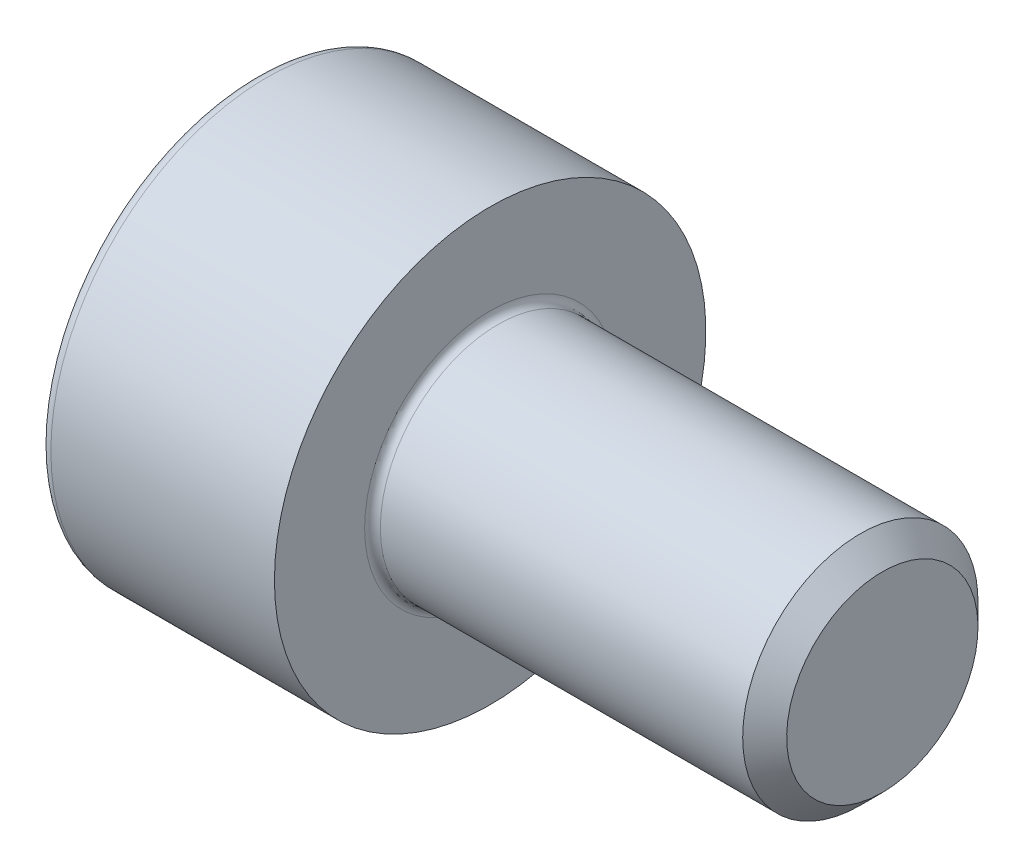
ISO-10303-21;
HEADER;
FILE_DESCRIPTION(('STEP AP214'),'2;1');
FILE_NAME('part.step','',(''),(''),'','','');
FILE_SCHEMA(('AUTOMOTIVE_DESIGN { 1 0 10303 214 1 1 1 1 }'));
ENDSEC;
DATA;
#1=APPLICATION_CONTEXT('core data for automotive mechanical design processes');
#2=APPLICATION_PROTOCOL_DEFINITION('international standard','automotive_design',2000,#1);
#3=PRODUCT_CONTEXT('',#1,'mechanical');
#4=PRODUCT('Part','Part','',(#3));
#5=PRODUCT_RELATED_PRODUCT_CATEGORY('part','',(#4));
#6=PRODUCT_DEFINITION_FORMATION('','',#4);
#7=PRODUCT_DEFINITION_CONTEXT('part definition',#1,'design');
#8=PRODUCT_DEFINITION('design','',#6,#7);
#9=PRODUCT_DEFINITION_SHAPE('','',#8);
#10=(LENGTH_UNIT() NAMED_UNIT(*) SI_UNIT(.MILLI.,.METRE.));
#11=(NAMED_UNIT(*) PLANE_ANGLE_UNIT() SI_UNIT($,.RADIAN.));
#12=(NAMED_UNIT(*) SI_UNIT($,.STERADIAN.) SOLID_ANGLE_UNIT());
#13=UNCERTAINTY_MEASURE_WITH_UNIT(LENGTH_MEASURE(1.E-05),#10,'distance_accuracy_value','');
#14=(GEOMETRIC_REPRESENTATION_CONTEXT(3) GLOBAL_UNCERTAINTY_ASSIGNED_CONTEXT((#13)) GLOBAL_UNIT_ASSIGNED_CONTEXT((#10,
#11,#12)) REPRESENTATION_CONTEXT('',''));
#15=CARTESIAN_POINT('',(0.,0.,0.));
#16=DIRECTION('',(0.,0.,1.));
#17=DIRECTION('',(1.,0.,0.));
#18=AXIS2_PLACEMENT_3D('',#15,#16,#17);
#19=CARTESIAN_POINT('',(8.,1.2195,0.));
#20=DIRECTION('',(1.,0.,0.));
#21=DIRECTION('',(0.,0.,-1.));
#22=AXIS2_PLACEMENT_3D('',#19,#20,#21);
#23=PLANE('',#22);
#24=CARTESIAN_POINT('',(7.99999999992451,0.,0.));
#25=DIRECTION('',(-1.,0.,0.));
#26=DIRECTION('',(0.,-1.,0.));
#27=AXIS2_PLACEMENT_3D('',#24,#25,#26);
#28=CIRCLE('',#27,1.2194999999906);
#29=CARTESIAN_POINT('',(7.99999999992451,-1.2194999999906,0.));
#30=VERTEX_POINT('',#29);
#31=EDGE_CURVE('E115',#30,#30,#28,.T.);
#32=ORIENTED_EDGE('',*,*,#31,.F.);
#33=EDGE_LOOP('',(#32));
#34=FACE_BOUND('',#33,.T.);
#35=ADVANCED_FACE('F16',(#34),#23,.T.);
#36=CARTESIAN_POINT('',(1.30000000012842,0.,0.));
#37=DIRECTION('',(-1.,0.,0.));
#38=DIRECTION('',(0.,0.,1.));
#39=AXIS2_PLACEMENT_3D('',#36,#37,#38);
#40=CONICAL_SURFACE('',#39,1.27999999978101,1.04719755091874);
#41=CARTESIAN_POINT('',(2.0390083446955,0.,2.8421709430404E-10));
#42=VERTEX_POINT('',#41);
#43=VERTEX_LOOP('',#42);
#44=FACE_BOUND('',#43,.T.);
#45=CARTESIAN_POINT('',(1.29999999999715,0.,0.));
#46=DIRECTION('',(-1.,0.,0.));
#47=DIRECTION('',(0.,0.,1.));
#48=AXIS2_PLACEMENT_3D('',#45,#46,#47);
#49=CIRCLE('',#48,1.28000000000839);
#50=CARTESIAN_POINT('',(1.29999999999857,-1.10851251684771,0.640000000002098));
#51=VERTEX_POINT('',#50);
#52=CARTESIAN_POINT('',(1.30000000000226,0.,1.28000000000209));
#53=VERTEX_POINT('',#52);
#54=EDGE_CURVE('E103',#51,#53,#49,.T.);
#55=ORIENTED_EDGE('',*,*,#54,.T.);
#56=CARTESIAN_POINT('',(1.29999999999715,0.,0.));
#57=DIRECTION('',(-1.,0.,0.));
#58=DIRECTION('',(0.,0.,1.));
#59=AXIS2_PLACEMENT_3D('',#56,#57,#58);
#60=CIRCLE('',#59,1.28000000000839);
#61=CARTESIAN_POINT('',(1.29999999999857,1.10851251684771,0.640000000002095));
#62=VERTEX_POINT('',#61);
#63=EDGE_CURVE('E106',#53,#62,#60,.T.);
#64=ORIENTED_EDGE('',*,*,#63,.T.);
#65=CARTESIAN_POINT('',(1.29999999999715,0.,0.));
#66=DIRECTION('',(-1.,0.,0.));
#67=DIRECTION('',(0.,0.,1.));
#68=AXIS2_PLACEMENT_3D('',#65,#66,#67);
#69=CIRCLE('',#68,1.28000000000839);
#70=CARTESIAN_POINT('',(1.29999999999857,1.10851251684771,-0.640000000002099));
#71=VERTEX_POINT('',#70);
#72=EDGE_CURVE('E109',#62,#71,#69,.T.);
#73=ORIENTED_EDGE('',*,*,#72,.T.);
#74=CARTESIAN_POINT('',(1.29999999999715,0.,0.));
#75=DIRECTION('',(-1.,0.,0.));
#76=DIRECTION('',(0.,0.,1.));
#77=AXIS2_PLACEMENT_3D('',#74,#75,#76);
#78=CIRCLE('',#77,1.28000000000839);
#79=CARTESIAN_POINT('',(1.30000000000226,0.,-1.28000000000629));
#80=VERTEX_POINT('',#79);
#81=EDGE_CURVE('E126',#71,#80,#78,.T.);
#82=ORIENTED_EDGE('',*,*,#81,.T.);
#83=CARTESIAN_POINT('',(1.29999999999715,0.,0.));
#84=DIRECTION('',(-1.,0.,0.));
#85=DIRECTION('',(0.,0.,1.));
#86=AXIS2_PLACEMENT_3D('',#83,#84,#85);
#87=CIRCLE('',#86,1.28000000000839);
#88=CARTESIAN_POINT('',(1.29999999999857,-1.10851251684771,-0.640000000002097));
#89=VERTEX_POINT('',#88);
#90=EDGE_CURVE('E127',#80,#89,#87,.T.);
#91=ORIENTED_EDGE('',*,*,#90,.T.);
#92=CARTESIAN_POINT('',(1.29999999999715,0.,0.));
#93=DIRECTION('',(-1.,0.,0.));
#94=DIRECTION('',(0.,0.,1.));
#95=AXIS2_PLACEMENT_3D('',#92,#93,#94);
#96=CIRCLE('',#95,1.28000000000839);
#97=EDGE_CURVE('E258',#89,#51,#96,.T.);
#98=ORIENTED_EDGE('',*,*,#97,.T.);
#99=EDGE_LOOP('',(#55,#64,#73,#82,#91,#98));
#100=FACE_BOUND('',#99,.T.);
#101=ADVANCED_FACE('F108',(#44,#100),#40,.F.);
#102=CARTESIAN_POINT('',(7.71950000000743,0.,0.));
#103=DIRECTION('',(-1.,0.,0.));
#104=DIRECTION('',(0.,-1.,0.));
#105=AXIS2_PLACEMENT_3D('',#102,#103,#104);
#106=CONICAL_SURFACE('',#105,1.49999999996453,0.785398163498773);
#107=CARTESIAN_POINT('',(7.71949999999995,0.,0.));
#108=DIRECTION('',(-1.,0.,0.));
#109=DIRECTION('',(0.,0.,1.));
#110=AXIS2_PLACEMENT_3D('',#107,#108,#109);
#111=CIRCLE('',#110,1.49999999999997);
#112=CARTESIAN_POINT('',(7.71949999999995,0.,1.49999999999997));
#113=VERTEX_POINT('',#112);
#114=EDGE_CURVE('E143',#113,#113,#111,.T.);
#115=ORIENTED_EDGE('',*,*,#114,.F.);
#116=EDGE_LOOP('',(#115));
#117=FACE_BOUND('',#116,.T.);
#118=ORIENTED_EDGE('',*,*,#31,.T.);
#119=EDGE_LOOP('',(#118));
#120=FACE_BOUND('',#119,.T.);
#121=ADVANCED_FACE('F618',(#117,#120),#106,.T.);
#122=CARTESIAN_POINT('',(1.3,1.47801668912544,0.));
#123=DIRECTION('',(1.,0.,0.));
#124=DIRECTION('',(0.,0.,-1.));
#125=AXIS2_PLACEMENT_3D('',#122,#123,#124);
#126=PLANE('',#125);
#127=DIRECTION('',(0.,0.499999999999999,-0.866025403784439));
#128=VECTOR('',#127,1.);
#129=CARTESIAN_POINT('',(1.3,1.47801668912544,0.));
#130=LINE('',#129,#128);
#131=CARTESIAN_POINT('',(1.3,0.73900834456272,1.28));
#132=VERTEX_POINT('',#131);
#133=EDGE_CURVE('E130',#62,#132,#130,.F.);
#134=ORIENTED_EDGE('',*,*,#133,.F.);
#135=ORIENTED_EDGE('',*,*,#63,.F.);
#136=DIRECTION('',(0.,-1.,0.));
#137=VECTOR('',#136,1.);
#138=CARTESIAN_POINT('',(1.3,-0.739008344562723,1.28));
#139=LINE('',#138,#137);
#140=EDGE_CURVE('E132',#53,#132,#139,.F.);
#141=ORIENTED_EDGE('',*,*,#140,.T.);
#142=EDGE_LOOP('',(#134,#135,#141));
#143=FACE_BOUND('',#142,.T.);
#144=ADVANCED_FACE('F131',(#143),#126,.F.);
#145=CARTESIAN_POINT('',(1.3,1.47801668912544,0.));
#146=DIRECTION('',(1.,0.,0.));
#147=DIRECTION('',(0.,0.,-1.));
#148=AXIS2_PLACEMENT_3D('',#145,#146,#147);
#149=PLANE('',#148);
#150=DIRECTION('',(0.,-1.,0.));
#151=VECTOR('',#150,1.);
#152=CARTESIAN_POINT('',(1.3,-0.739008344562723,1.28));
#153=LINE('',#152,#151);
#154=CARTESIAN_POINT('',(1.3,-0.739008344562723,1.28));
#155=VERTEX_POINT('',#154);
#156=EDGE_CURVE('E137',#155,#53,#153,.F.);
#157=ORIENTED_EDGE('',*,*,#156,.T.);
#158=ORIENTED_EDGE('',*,*,#54,.F.);
#159=DIRECTION('',(0.,0.500000000000001,0.866025403784438));
#160=VECTOR('',#159,1.);
#161=CARTESIAN_POINT('',(1.3,-0.739008344562723,1.28));
#162=LINE('',#161,#160);
#163=EDGE_CURVE('E204',#155,#51,#162,.F.);
#164=ORIENTED_EDGE('',*,*,#163,.F.);
#165=EDGE_LOOP('',(#157,#158,#164));
#166=FACE_BOUND('',#165,.T.);
#167=ADVANCED_FACE('F450',(#166),#149,.F.);
#168=CARTESIAN_POINT('',(1.3,1.47801668912544,0.));
#169=DIRECTION('',(1.,0.,0.));
#170=DIRECTION('',(0.,0.,-1.));
#171=AXIS2_PLACEMENT_3D('',#168,#169,#170);
#172=PLANE('',#171);
#173=DIRECTION('',(0.,0.500000000000001,0.866025403784438));
#174=VECTOR('',#173,1.);
#175=CARTESIAN_POINT('',(1.3,-0.739008344562723,1.28));
#176=LINE('',#175,#174);
#177=CARTESIAN_POINT('',(1.3,-1.47801668912545,0.));
#178=VERTEX_POINT('',#177);
#179=EDGE_CURVE('E199',#51,#178,#176,.F.);
#180=ORIENTED_EDGE('',*,*,#179,.F.);
#181=ORIENTED_EDGE('',*,*,#97,.F.);
#182=DIRECTION('',(0.,-0.499999999999999,0.866025403784439));
#183=VECTOR('',#182,1.);
#184=CARTESIAN_POINT('',(1.3,-1.47801668912545,0.));
#185=LINE('',#184,#183);
#186=EDGE_CURVE('E182',#178,#89,#185,.F.);
#187=ORIENTED_EDGE('',*,*,#186,.F.);
#188=EDGE_LOOP('',(#180,#181,#187));
#189=FACE_BOUND('',#188,.T.);
#190=ADVANCED_FACE('F445',(#189),#172,.F.);
#191=CARTESIAN_POINT('',(1.3,1.47801668912544,0.));
#192=DIRECTION('',(1.,0.,0.));
#193=DIRECTION('',(0.,0.,-1.));
#194=AXIS2_PLACEMENT_3D('',#191,#192,#193);
#195=PLANE('',#194);
#196=DIRECTION('',(0.,-0.499999999999999,0.866025403784439));
#197=VECTOR('',#196,1.);
#198=CARTESIAN_POINT('',(1.3,-1.47801668912545,0.));
#199=LINE('',#198,#197);
#200=CARTESIAN_POINT('',(1.3,-0.739008344562726,-1.28));
#201=VERTEX_POINT('',#200);
#202=EDGE_CURVE('E178',#89,#201,#199,.F.);
#203=ORIENTED_EDGE('',*,*,#202,.F.);
#204=ORIENTED_EDGE('',*,*,#90,.F.);
#205=DIRECTION('',(0.,1.,0.));
#206=VECTOR('',#205,1.);
#207=CARTESIAN_POINT('',(1.3,0.739008344562715,-1.28));
#208=LINE('',#207,#206);
#209=EDGE_CURVE('E171',#80,#201,#208,.F.);
#210=ORIENTED_EDGE('',*,*,#209,.T.);
#211=EDGE_LOOP('',(#203,#204,#210));
#212=FACE_BOUND('',#211,.T.);
#213=ADVANCED_FACE('F440',(#212),#195,.F.);
#214=CARTESIAN_POINT('',(1.3,1.47801668912544,0.));
#215=DIRECTION('',(1.,0.,0.));
#216=DIRECTION('',(0.,0.,-1.));
#217=AXIS2_PLACEMENT_3D('',#214,#215,#216);
#218=PLANE('',#217);
#219=DIRECTION('',(0.,0.500000000000002,0.866025403784438));
#220=VECTOR('',#219,1.);
#221=CARTESIAN_POINT('',(1.3,1.47801668912544,0.));
#222=LINE('',#221,#220);
#223=CARTESIAN_POINT('',(1.3,1.47801668912544,0.));
#224=VERTEX_POINT('',#223);
#225=EDGE_CURVE('E123',#224,#71,#222,.F.);
#226=ORIENTED_EDGE('',*,*,#225,.T.);
#227=ORIENTED_EDGE('',*,*,#72,.F.);
#228=DIRECTION('',(0.,0.499999999999999,-0.866025403784439));
#229=VECTOR('',#228,1.);
#230=CARTESIAN_POINT('',(1.3,1.47801668912544,0.));
#231=LINE('',#230,#229);
#232=EDGE_CURVE('E120',#224,#62,#231,.F.);
#233=ORIENTED_EDGE('',*,*,#232,.F.);
#234=EDGE_LOOP('',(#226,#227,#233));
#235=FACE_BOUND('',#234,.T.);
#236=ADVANCED_FACE('F118',(#235),#218,.F.);
#237=CARTESIAN_POINT('',(1.3,1.47801668912544,0.));
#238=DIRECTION('',(1.,0.,0.));
#239=DIRECTION('',(0.,0.,-1.));
#240=AXIS2_PLACEMENT_3D('',#237,#238,#239);
#241=PLANE('',#240);
#242=DIRECTION('',(0.,1.,0.));
#243=VECTOR('',#242,1.);
#244=CARTESIAN_POINT('',(1.3,0.739008344562715,-1.28));
#245=LINE('',#244,#243);
#246=CARTESIAN_POINT('',(1.3,0.739008344562716,-1.28));
#247=VERTEX_POINT('',#246);
#248=EDGE_CURVE('E175',#247,#80,#245,.F.);
#249=ORIENTED_EDGE('',*,*,#248,.T.);
#250=ORIENTED_EDGE('',*,*,#81,.F.);
#251=DIRECTION('',(0.,0.500000000000002,0.866025403784438));
#252=VECTOR('',#251,1.);
#253=CARTESIAN_POINT('',(1.3,1.47801668912544,0.));
#254=LINE('',#253,#252);
#255=EDGE_CURVE('E366',#71,#247,#254,.F.);
#256=ORIENTED_EDGE('',*,*,#255,.T.);
#257=EDGE_LOOP('',(#249,#250,#256));
#258=FACE_BOUND('',#257,.T.);
#259=ADVANCED_FACE('F566',(#258),#241,.F.);
#260=CARTESIAN_POINT('',(-31.75,0.,0.));
#261=DIRECTION('',(-1.,0.,0.));
#262=DIRECTION('',(0.,0.,1.));
#263=AXIS2_PLACEMENT_3D('',#260,#261,#262);
#264=CYLINDRICAL_SURFACE('',#263,1.49999999999997);
#265=CARTESIAN_POINT('',(3.10000000000001,0.,0.));
#266=DIRECTION('',(1.,0.,0.));
#267=DIRECTION('',(0.,0.,-1.));
#268=AXIS2_PLACEMENT_3D('',#265,#266,#267);
#269=CIRCLE('',#268,1.49999999999997);
#270=CARTESIAN_POINT('',(3.10000000000001,0.,-1.49999999999997));
#271=VERTEX_POINT('',#270);
#272=EDGE_CURVE('E161',#271,#271,#269,.T.);
#273=ORIENTED_EDGE('',*,*,#272,.T.);
#274=EDGE_LOOP('',(#273));
#275=FACE_BOUND('',#274,.T.);
#276=ORIENTED_EDGE('',*,*,#114,.T.);
#277=EDGE_LOOP('',(#276));
#278=FACE_BOUND('',#277,.T.);
#279=ADVANCED_FACE('F461',(#275,#278),#264,.T.);
#280=CARTESIAN_POINT('',(1.3,1.47801668912544,0.));
#281=DIRECTION('',(0.,-0.866025403784439,-0.499999999999999));
#282=DIRECTION('',(0.,0.499999999999999,-0.866025403784439));
#283=AXIS2_PLACEMENT_3D('',#280,#281,#282);
#284=PLANE('',#283);
#285=ORIENTED_EDGE('',*,*,#133,.T.);
#286=DIRECTION('',(1.,0.,0.));
#287=VECTOR('',#286,1.);
#288=CARTESIAN_POINT('',(1.3,0.73900834456272,1.28));
#289=LINE('',#288,#287);
#290=CARTESIAN_POINT('',(0.,0.73900834456272,1.28));
#291=VERTEX_POINT('',#290);
#292=EDGE_CURVE('E228',#132,#291,#289,.F.);
#293=ORIENTED_EDGE('',*,*,#292,.T.);
#294=DIRECTION('',(0.,-0.499999999999999,0.866025403784439));
#295=VECTOR('',#294,1.);
#296=CARTESIAN_POINT('',(0.,1.47801668912544,0.));
#297=LINE('',#296,#295);
#298=CARTESIAN_POINT('',(0.,1.47801668912544,0.));
#299=VERTEX_POINT('',#298);
#300=EDGE_CURVE('E156',#299,#291,#297,.T.);
#301=ORIENTED_EDGE('',*,*,#300,.F.);
#302=DIRECTION('',(1.,0.,0.));
#303=VECTOR('',#302,1.);
#304=CARTESIAN_POINT('',(1.3,1.47801668912544,0.));
#305=LINE('',#304,#303);
#306=EDGE_CURVE('E141',#299,#224,#305,.T.);
#307=ORIENTED_EDGE('',*,*,#306,.T.);
#308=ORIENTED_EDGE('',*,*,#232,.T.);
#309=EDGE_LOOP('',(#285,#293,#301,#307,#308));
#310=FACE_BOUND('',#309,.T.);
#311=ADVANCED_FACE('F139',(#310),#284,.T.);
#312=CARTESIAN_POINT('',(1.3,-0.739008344562723,1.28));
#313=DIRECTION('',(0.,0.,1.));
#314=DIRECTION('',(0.,-1.,0.));
#315=AXIS2_PLACEMENT_3D('',#312,#313,#314);
#316=PLANE('',#315);
#317=ORIENTED_EDGE('',*,*,#292,.F.);
#318=ORIENTED_EDGE('',*,*,#140,.F.);
#319=ORIENTED_EDGE('',*,*,#156,.F.);
#320=DIRECTION('',(1.,0.,0.));
#321=VECTOR('',#320,1.);
#322=CARTESIAN_POINT('',(1.3,-0.739008344562723,1.28));
#323=LINE('',#322,#321);
#324=CARTESIAN_POINT('',(0.,-0.739008344562723,1.28));
#325=VERTEX_POINT('',#324);
#326=EDGE_CURVE('E222',#325,#155,#323,.T.);
#327=ORIENTED_EDGE('',*,*,#326,.F.);
#328=DIRECTION('',(0.,1.,0.));
#329=VECTOR('',#328,1.);
#330=CARTESIAN_POINT('',(0.,0.,1.28));
#331=LINE('',#330,#329);
#332=EDGE_CURVE('E160',#291,#325,#331,.F.);
#333=ORIENTED_EDGE('',*,*,#332,.F.);
#334=EDGE_LOOP('',(#317,#318,#319,#327,#333));
#335=FACE_BOUND('',#334,.T.);
#336=ADVANCED_FACE('F452',(#335),#316,.F.);
#337=CARTESIAN_POINT('',(1.3,-0.739008344562723,1.28));
#338=DIRECTION('',(0.,0.866025403784438,-0.500000000000001));
#339=DIRECTION('',(0.,0.500000000000001,0.866025403784438));
#340=AXIS2_PLACEMENT_3D('',#337,#338,#339);
#341=PLANE('',#340);
#342=ORIENTED_EDGE('',*,*,#179,.T.);
#343=DIRECTION('',(1.,0.,0.));
#344=VECTOR('',#343,1.);
#345=CARTESIAN_POINT('',(1.3,-1.47801668912545,0.));
#346=LINE('',#345,#344);
#347=CARTESIAN_POINT('',(0.,-1.47801668912545,0.));
#348=VERTEX_POINT('',#347);
#349=EDGE_CURVE('E193',#348,#178,#346,.T.);
#350=ORIENTED_EDGE('',*,*,#349,.F.);
#351=DIRECTION('',(0.,-0.500000000000001,-0.866025403784438));
#352=VECTOR('',#351,1.);
#353=CARTESIAN_POINT('',(0.,-0.739008344562723,1.28));
#354=LINE('',#353,#352);
#355=EDGE_CURVE('E211',#325,#348,#354,.T.);
#356=ORIENTED_EDGE('',*,*,#355,.F.);
#357=ORIENTED_EDGE('',*,*,#326,.T.);
#358=ORIENTED_EDGE('',*,*,#163,.T.);
#359=EDGE_LOOP('',(#342,#350,#356,#357,#358));
#360=FACE_BOUND('',#359,.T.);
#361=ADVANCED_FACE('F448',(#360),#341,.T.);
#362=CARTESIAN_POINT('',(1.3,-1.47801668912545,0.));
#363=DIRECTION('',(0.,0.866025403784439,0.499999999999999));
#364=DIRECTION('',(0.,-0.499999999999999,0.866025403784439));
#365=AXIS2_PLACEMENT_3D('',#362,#363,#364);
#366=PLANE('',#365);
#367=ORIENTED_EDGE('',*,*,#202,.T.);
#368=DIRECTION('',(1.,0.,0.));
#369=VECTOR('',#368,1.);
#370=CARTESIAN_POINT('',(1.3,-0.739008344562726,-1.28));
#371=LINE('',#370,#369);
#372=CARTESIAN_POINT('',(0.,-0.739008344562726,-1.28));
#373=VERTEX_POINT('',#372);
#374=EDGE_CURVE('E174',#201,#373,#371,.F.);
#375=ORIENTED_EDGE('',*,*,#374,.T.);
#376=DIRECTION('',(0.,0.499999999999999,-0.866025403784439));
#377=VECTOR('',#376,1.);
#378=CARTESIAN_POINT('',(0.,-1.47801668912545,0.));
#379=LINE('',#378,#377);
#380=EDGE_CURVE('E207',#348,#373,#379,.T.);
#381=ORIENTED_EDGE('',*,*,#380,.F.);
#382=ORIENTED_EDGE('',*,*,#349,.T.);
#383=ORIENTED_EDGE('',*,*,#186,.T.);
#384=EDGE_LOOP('',(#367,#375,#381,#382,#383));
#385=FACE_BOUND('',#384,.T.);
#386=ADVANCED_FACE('F436',(#385),#366,.T.);
#387=CARTESIAN_POINT('',(1.3,0.739008344562715,-1.28));
#388=DIRECTION('',(0.,0.,-1.));
#389=DIRECTION('',(0.,1.,0.));
#390=AXIS2_PLACEMENT_3D('',#387,#388,#389);
#391=PLANE('',#390);
#392=ORIENTED_EDGE('',*,*,#374,.F.);
#393=ORIENTED_EDGE('',*,*,#209,.F.);
#394=ORIENTED_EDGE('',*,*,#248,.F.);
#395=DIRECTION('',(1.,0.,0.));
#396=VECTOR('',#395,1.);
#397=CARTESIAN_POINT('',(1.3,0.739008344562715,-1.28));
#398=LINE('',#397,#396);
#399=CARTESIAN_POINT('',(0.,0.739008344562716,-1.28));
#400=VERTEX_POINT('',#399);
#401=EDGE_CURVE('E363',#247,#400,#398,.F.);
#402=ORIENTED_EDGE('',*,*,#401,.T.);
#403=DIRECTION('',(0.,1.,0.));
#404=VECTOR('',#403,1.);
#405=CARTESIAN_POINT('',(0.,0.,-1.28));
#406=LINE('',#405,#404);
#407=EDGE_CURVE('E168',#373,#400,#406,.T.);
#408=ORIENTED_EDGE('',*,*,#407,.F.);
#409=EDGE_LOOP('',(#392,#393,#394,#402,#408));
#410=FACE_BOUND('',#409,.T.);
#411=ADVANCED_FACE('F425',(#410),#391,.F.);
#412=CARTESIAN_POINT('',(1.3,1.47801668912544,0.));
#413=DIRECTION('',(0.,0.866025403784438,-0.500000000000002));
#414=DIRECTION('',(0.,0.500000000000002,0.866025403784438));
#415=AXIS2_PLACEMENT_3D('',#412,#413,#414);
#416=PLANE('',#415);
#417=ORIENTED_EDGE('',*,*,#401,.F.);
#418=ORIENTED_EDGE('',*,*,#255,.F.);
#419=ORIENTED_EDGE('',*,*,#225,.F.);
#420=ORIENTED_EDGE('',*,*,#306,.F.);
#421=DIRECTION('',(0.,0.500000000000002,0.866025403784437));
#422=VECTOR('',#421,1.);
#423=CARTESIAN_POINT('',(0.,0.739008344562715,-1.28));
#424=LINE('',#423,#422);
#425=EDGE_CURVE('E164',#400,#299,#424,.T.);
#426=ORIENTED_EDGE('',*,*,#425,.F.);
#427=EDGE_LOOP('',(#417,#418,#419,#420,#426));
#428=FACE_BOUND('',#427,.T.);
#429=ADVANCED_FACE('F430',(#428),#416,.F.);
#430=CARTESIAN_POINT('',(3.10000000000001,0.,0.));
#431=DIRECTION('',(1.,0.,0.));
#432=DIRECTION('',(0.,0.,-1.));
#433=AXIS2_PLACEMENT_3D('',#430,#431,#432);
#434=TOROIDAL_SURFACE('',#433,1.59999999999997,0.1);
#435=ORIENTED_EDGE('',*,*,#272,.F.);
#436=EDGE_LOOP('',(#435));
#437=FACE_BOUND('',#436,.T.);
#438=CARTESIAN_POINT('',(3.00000000000001,0.,0.));
#439=DIRECTION('',(1.,0.,0.));
#440=DIRECTION('',(0.,0.,1.));
#441=AXIS2_PLACEMENT_3D('',#438,#439,#440);
#442=CIRCLE('',#441,1.59999999999997);
#443=CARTESIAN_POINT('',(3.,0.,-1.59999999999997));
#444=VERTEX_POINT('',#443);
#445=CARTESIAN_POINT('',(3.,0.,1.59999999999997));
#446=VERTEX_POINT('',#445);
#447=EDGE_CURVE('E294',#444,#446,#442,.F.);
#448=ORIENTED_EDGE('',*,*,#447,.F.);
#449=CARTESIAN_POINT('',(3.00000000000001,0.,0.));
#450=DIRECTION('',(1.,0.,0.));
#451=DIRECTION('',(0.,0.,-1.));
#452=AXIS2_PLACEMENT_3D('',#449,#450,#451);
#453=CIRCLE('',#452,1.59999999999997);
#454=EDGE_CURVE('E304',#446,#444,#453,.F.);
#455=ORIENTED_EDGE('',*,*,#454,.F.);
#456=EDGE_LOOP('',(#448,#455));
#457=FACE_BOUND('',#456,.T.);
#458=ADVANCED_FACE('F325',(#437,#457),#434,.F.);
#459=CARTESIAN_POINT('',(0.,0.,0.));
#460=DIRECTION('',(-1.,0.,0.));
#461=DIRECTION('',(0.,0.,1.));
#462=AXIS2_PLACEMENT_3D('',#459,#460,#461);
#463=PLANE('',#462);
#464=CARTESIAN_POINT('',(0.,0.,0.));
#465=DIRECTION('',(1.,0.,0.));
#466=DIRECTION('',(0.,0.,-1.));
#467=AXIS2_PLACEMENT_3D('',#464,#465,#466);
#468=CIRCLE('',#467,2.6);
#469=CARTESIAN_POINT('',(0.,0.,-2.6));
#470=VERTEX_POINT('',#469);
#471=CARTESIAN_POINT('',(0.,0.,2.6));
#472=VERTEX_POINT('',#471);
#473=EDGE_CURVE('E253',#470,#472,#468,.T.);
#474=ORIENTED_EDGE('',*,*,#473,.F.);
#475=CARTESIAN_POINT('',(0.,0.,0.));
#476=DIRECTION('',(1.,0.,0.));
#477=DIRECTION('',(0.,0.,1.));
#478=AXIS2_PLACEMENT_3D('',#475,#476,#477);
#479=CIRCLE('',#478,2.6);
#480=EDGE_CURVE('E40',#472,#470,#479,.T.);
#481=ORIENTED_EDGE('',*,*,#480,.F.);
#482=EDGE_LOOP('',(#474,#481));
#483=FACE_BOUND('',#482,.T.);
#484=ORIENTED_EDGE('',*,*,#407,.T.);
#485=ORIENTED_EDGE('',*,*,#425,.T.);
#486=ORIENTED_EDGE('',*,*,#300,.T.);
#487=ORIENTED_EDGE('',*,*,#332,.T.);
#488=ORIENTED_EDGE('',*,*,#355,.T.);
#489=ORIENTED_EDGE('',*,*,#380,.T.);
#490=EDGE_LOOP('',(#484,#485,#486,#487,#488,#489));
#491=FACE_BOUND('',#490,.T.);
#492=ADVANCED_FACE('F317',(#483,#491),#463,.T.);
#493=CARTESIAN_POINT('',(3.,2.75,0.));
#494=DIRECTION('',(1.,0.,0.));
#495=DIRECTION('',(0.,0.,-1.));
#496=AXIS2_PLACEMENT_3D('',#493,#494,#495);
#497=PLANE('',#496);
#498=CARTESIAN_POINT('',(3.,0.,0.));
#499=DIRECTION('',(-1.,0.,0.));
#500=DIRECTION('',(0.,0.,1.));
#501=AXIS2_PLACEMENT_3D('',#498,#499,#500);
#502=CIRCLE('',#501,2.75);
#503=CARTESIAN_POINT('',(3.,0.,2.75));
#504=VERTEX_POINT('',#503);
#505=EDGE_CURVE('E28',#504,#504,#502,.T.);
#506=ORIENTED_EDGE('',*,*,#505,.F.);
#507=EDGE_LOOP('',(#506));
#508=FACE_BOUND('',#507,.T.);
#509=ORIENTED_EDGE('',*,*,#447,.T.);
#510=ORIENTED_EDGE('',*,*,#454,.T.);
#511=EDGE_LOOP('',(#509,#510));
#512=FACE_BOUND('',#511,.T.);
#513=ADVANCED_FACE('F283',(#508,#512),#497,.T.);
#514=CARTESIAN_POINT('',(0.149999999999997,0.,0.));
#515=DIRECTION('',(-1.,0.,0.));
#516=DIRECTION('',(0.,0.,1.));
#517=AXIS2_PLACEMENT_3D('',#514,#515,#516);
#518=TOROIDAL_SURFACE('',#517,2.6,0.15);
#519=ORIENTED_EDGE('',*,*,#480,.T.);
#520=ORIENTED_EDGE('',*,*,#473,.T.);
#521=EDGE_LOOP('',(#519,#520));
#522=FACE_BOUND('',#521,.T.);
#523=CARTESIAN_POINT('',(0.149999999999997,0.,0.));
#524=DIRECTION('',(-1.,0.,0.));
#525=DIRECTION('',(0.,0.,1.));
#526=AXIS2_PLACEMENT_3D('',#523,#524,#525);
#527=CIRCLE('',#526,2.75);
#528=CARTESIAN_POINT('',(0.149999999999997,0.,2.75));
#529=VERTEX_POINT('',#528);
#530=EDGE_CURVE('E11',#529,#529,#527,.F.);
#531=ORIENTED_EDGE('',*,*,#530,.F.);
#532=EDGE_LOOP('',(#531));
#533=FACE_BOUND('',#532,.T.);
#534=ADVANCED_FACE('F271',(#522,#533),#518,.T.);
#535=CARTESIAN_POINT('',(-31.75,0.,0.));
#536=DIRECTION('',(-1.,0.,0.));
#537=DIRECTION('',(0.,0.,1.));
#538=AXIS2_PLACEMENT_3D('',#535,#536,#537);
#539=CYLINDRICAL_SURFACE('',#538,2.75);
#540=ORIENTED_EDGE('',*,*,#530,.T.);
#541=EDGE_LOOP('',(#540));
#542=FACE_BOUND('',#541,.T.);
#543=ORIENTED_EDGE('',*,*,#505,.T.);
#544=EDGE_LOOP('',(#543));
#545=FACE_BOUND('',#544,.T.);
#546=ADVANCED_FACE('F282',(#542,#545),#539,.T.);
#547=CLOSED_SHELL('',(#35,#101,#121,#144,#167,#190,#213,#236,#259,#279,#311,#336,#361,#386,#411,
#429,#458,#492,#513,#534,#546));
#548=MANIFOLD_SOLID_BREP('B1',#547);
#549=ADVANCED_BREP_SHAPE_REPRESENTATION('',(#18,#548),#14);
#550=SHAPE_DEFINITION_REPRESENTATION(#9,#549);
ENDSEC;
END-ISO-10303-21;
